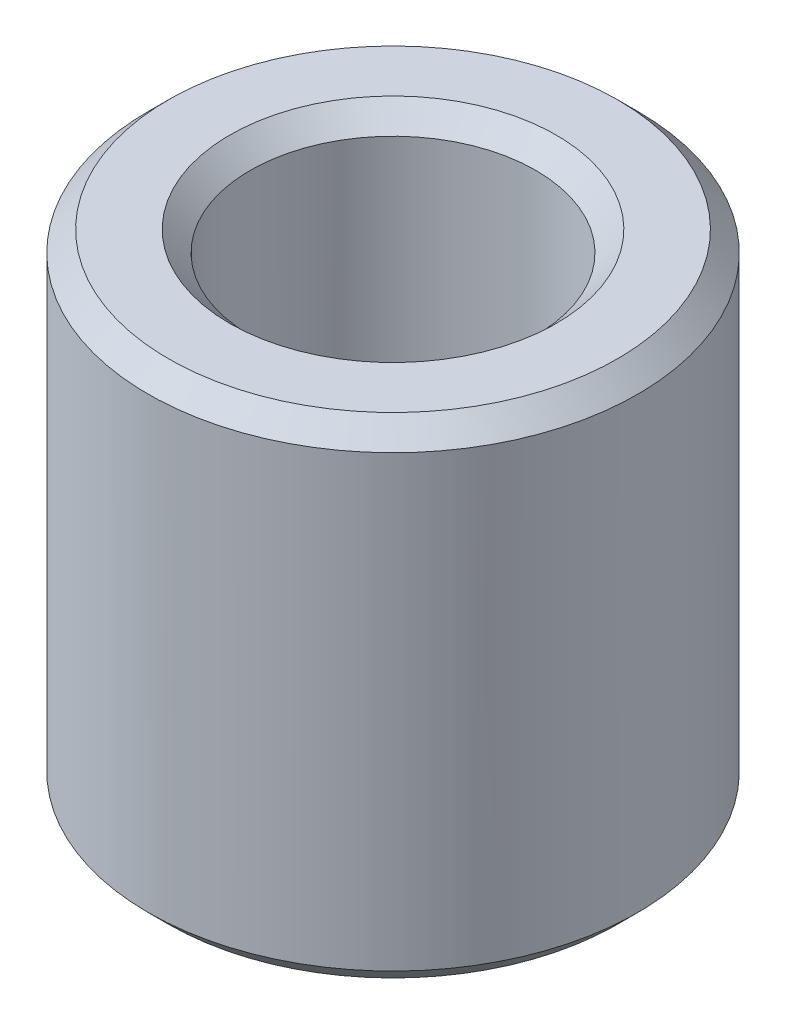
ISO-10303-21;
HEADER;
FILE_DESCRIPTION(('STEP AP214'),'2;1');
FILE_NAME('part.step','',(''),(''),'','','');
FILE_SCHEMA(('AUTOMOTIVE_DESIGN { 1 0 10303 214 1 1 1 1 }'));
ENDSEC;
DATA;
#1=APPLICATION_CONTEXT('core data for automotive mechanical design processes');
#2=APPLICATION_PROTOCOL_DEFINITION('international standard','automotive_design',2000,#1);
#3=PRODUCT_CONTEXT('',#1,'mechanical');
#4=PRODUCT('Part','Part','',(#3));
#5=PRODUCT_RELATED_PRODUCT_CATEGORY('part','',(#4));
#6=PRODUCT_DEFINITION_FORMATION('','',#4);
#7=PRODUCT_DEFINITION_CONTEXT('part definition',#1,'design');
#8=PRODUCT_DEFINITION('design','',#6,#7);
#9=PRODUCT_DEFINITION_SHAPE('','',#8);
#10=(LENGTH_UNIT() NAMED_UNIT(*) SI_UNIT(.MILLI.,.METRE.));
#11=(NAMED_UNIT(*) PLANE_ANGLE_UNIT() SI_UNIT($,.RADIAN.));
#12=(NAMED_UNIT(*) SI_UNIT($,.STERADIAN.) SOLID_ANGLE_UNIT());
#13=UNCERTAINTY_MEASURE_WITH_UNIT(LENGTH_MEASURE(1.E-05),#10,'distance_accuracy_value','');
#14=(GEOMETRIC_REPRESENTATION_CONTEXT(3) GLOBAL_UNCERTAINTY_ASSIGNED_CONTEXT((#13)) GLOBAL_UNIT_ASSIGNED_CONTEXT((#10,
#11,#12)) REPRESENTATION_CONTEXT('',''));
#15=CARTESIAN_POINT('',(0.,0.,0.));
#16=DIRECTION('',(0.,0.,1.));
#17=DIRECTION('',(1.,0.,0.));
#18=AXIS2_PLACEMENT_3D('',#15,#16,#17);
#19=CARTESIAN_POINT('',(0.,6.,0.));
#20=DIRECTION('',(0.,-1.,0.));
#21=DIRECTION('',(0.,0.,-1.));
#22=AXIS2_PLACEMENT_3D('',#19,#20,#21);
#23=CYLINDRICAL_SURFACE('',#22,1.75);
#24=CARTESIAN_POINT('',(0.,0.250000000050932,0.));
#25=DIRECTION('',(0.,-1.,0.));
#26=DIRECTION('',(0.,0.,-1.));
#27=AXIS2_PLACEMENT_3D('',#24,#25,#26);
#28=CIRCLE('',#27,1.75000000001546);
#29=CARTESIAN_POINT('',(0.,0.250000000050932,-1.75000000001546));
#30=VERTEX_POINT('',#29);
#31=EDGE_CURVE('E35',#30,#30,#28,.T.);
#32=ORIENTED_EDGE('',*,*,#31,.T.);
#33=EDGE_LOOP('',(#32));
#34=FACE_BOUND('',#33,.T.);
#35=CARTESIAN_POINT('',(0.,5.75000000003456,0.));
#36=DIRECTION('',(0.,1.,0.));
#37=DIRECTION('',(0.,0.,1.));
#38=AXIS2_PLACEMENT_3D('',#35,#36,#37);
#39=CIRCLE('',#38,1.75000000001546);
#40=CARTESIAN_POINT('',(0.,5.75000000003456,1.75000000001546));
#41=VERTEX_POINT('',#40);
#42=EDGE_CURVE('E32',#41,#41,#39,.T.);
#43=ORIENTED_EDGE('',*,*,#42,.T.);
#44=EDGE_LOOP('',(#43));
#45=FACE_BOUND('',#44,.T.);
#46=ADVANCED_FACE('F15',(#34,#45),#23,.F.);
#47=CARTESIAN_POINT('',(0.,0.,0.));
#48=DIRECTION('',(0.,-1.,0.));
#49=DIRECTION('',(0.,0.,-1.));
#50=AXIS2_PLACEMENT_3D('',#47,#48,#49);
#51=CONICAL_SURFACE('',#50,2.00000000000955,0.785398163283761);
#52=CARTESIAN_POINT('',(0.,0.,0.));
#53=DIRECTION('',(0.,-1.,0.));
#54=DIRECTION('',(0.,0.,-1.));
#55=AXIS2_PLACEMENT_3D('',#52,#53,#54);
#56=CIRCLE('',#55,2.00000000000955);
#57=CARTESIAN_POINT('',(0.,0.,-2.00000000000955));
#58=VERTEX_POINT('',#57);
#59=EDGE_CURVE('E18',#58,#58,#56,.T.);
#60=ORIENTED_EDGE('',*,*,#59,.T.);
#61=EDGE_LOOP('',(#60));
#62=FACE_BOUND('',#61,.T.);
#63=ORIENTED_EDGE('',*,*,#31,.F.);
#64=EDGE_LOOP('',(#63));
#65=FACE_BOUND('',#64,.T.);
#66=ADVANCED_FACE('F49',(#62,#65),#51,.F.);
#67=CARTESIAN_POINT('',(0.,6.00000000002865,0.));
#68=DIRECTION('',(0.,1.,0.));
#69=DIRECTION('',(0.,0.,1.));
#70=AXIS2_PLACEMENT_3D('',#67,#68,#69);
#71=CONICAL_SURFACE('',#70,2.00000000000955,0.785398163397448);
#72=CARTESIAN_POINT('',(0.,6.00000000002865,0.));
#73=DIRECTION('',(0.,1.,0.));
#74=DIRECTION('',(0.,0.,1.));
#75=AXIS2_PLACEMENT_3D('',#72,#73,#74);
#76=CIRCLE('',#75,2.00000000000955);
#77=CARTESIAN_POINT('',(0.,6.00000000002865,2.00000000000955));
#78=VERTEX_POINT('',#77);
#79=EDGE_CURVE('E42',#78,#78,#76,.F.);
#80=ORIENTED_EDGE('',*,*,#79,.F.);
#81=EDGE_LOOP('',(#80));
#82=FACE_BOUND('',#81,.T.);
#83=ORIENTED_EDGE('',*,*,#42,.F.);
#84=EDGE_LOOP('',(#83));
#85=FACE_BOUND('',#84,.T.);
#86=ADVANCED_FACE('F56',(#82,#85),#71,.F.);
#87=CARTESIAN_POINT('',(0.,0.,0.));
#88=DIRECTION('',(0.,1.,0.));
#89=DIRECTION('',(0.,0.,1.));
#90=AXIS2_PLACEMENT_3D('',#87,#88,#89);
#91=PLANE('',#90);
#92=ORIENTED_EDGE('',*,*,#59,.F.);
#93=EDGE_LOOP('',(#92));
#94=FACE_BOUND('',#93,.T.);
#95=CARTESIAN_POINT('',(0.,-5.6843418860808E-11,0.));
#96=DIRECTION('',(0.,1.,0.));
#97=DIRECTION('',(0.,0.,1.));
#98=AXIS2_PLACEMENT_3D('',#95,#96,#97);
#99=CIRCLE('',#98,2.74999999993497);
#100=CARTESIAN_POINT('',(0.,-5.6843418860808E-11,2.74999999993497));
#101=VERTEX_POINT('',#100);
#102=EDGE_CURVE('E40',#101,#101,#99,.T.);
#103=ORIENTED_EDGE('',*,*,#102,.F.);
#104=EDGE_LOOP('',(#103));
#105=FACE_BOUND('',#104,.T.);
#106=ADVANCED_FACE('F52',(#94,#105),#91,.F.);
#107=CARTESIAN_POINT('',(0.,6.,0.));
#108=DIRECTION('',(0.,1.,0.));
#109=DIRECTION('',(0.,0.,1.));
#110=AXIS2_PLACEMENT_3D('',#107,#108,#109);
#111=PLANE('',#110);
#112=ORIENTED_EDGE('',*,*,#79,.T.);
#113=EDGE_LOOP('',(#112));
#114=FACE_BOUND('',#113,.T.);
#115=CARTESIAN_POINT('',(0.,5.99999999997181,0.));
#116=DIRECTION('',(0.,-1.,0.));
#117=DIRECTION('',(0.,0.,-1.));
#118=AXIS2_PLACEMENT_3D('',#115,#116,#117);
#119=CIRCLE('',#118,2.74999999993497);
#120=CARTESIAN_POINT('',(0.,5.99999999997181,-2.74999999993497));
#121=VERTEX_POINT('',#120);
#122=EDGE_CURVE('E27',#121,#121,#119,.T.);
#123=ORIENTED_EDGE('',*,*,#122,.F.);
#124=EDGE_LOOP('',(#123));
#125=FACE_BOUND('',#124,.T.);
#126=ADVANCED_FACE('F55',(#114,#125),#111,.T.);
#127=CARTESIAN_POINT('',(0.,0.249999999937245,0.));
#128=DIRECTION('',(0.,1.,0.));
#129=DIRECTION('',(0.,0.,1.));
#130=AXIS2_PLACEMENT_3D('',#127,#128,#129);
#131=CONICAL_SURFACE('',#130,2.99999999992906,0.785398163397448);
#132=ORIENTED_EDGE('',*,*,#102,.T.);
#133=EDGE_LOOP('',(#132));
#134=FACE_BOUND('',#133,.T.);
#135=CARTESIAN_POINT('',(0.,0.25,0.));
#136=DIRECTION('',(0.,-1.,0.));
#137=DIRECTION('',(0.,0.,-1.));
#138=AXIS2_PLACEMENT_3D('',#135,#136,#137);
#139=CIRCLE('',#138,3.);
#140=CARTESIAN_POINT('',(0.,0.25,-3.));
#141=VERTEX_POINT('',#140);
#142=EDGE_CURVE('E22',#141,#141,#139,.F.);
#143=ORIENTED_EDGE('',*,*,#142,.F.);
#144=EDGE_LOOP('',(#143));
#145=FACE_BOUND('',#144,.T.);
#146=ADVANCED_FACE('F60',(#134,#145),#131,.T.);
#147=CARTESIAN_POINT('',(0.,5.74999999997772,0.));
#148=DIRECTION('',(0.,-1.,0.));
#149=DIRECTION('',(0.,0.,-1.));
#150=AXIS2_PLACEMENT_3D('',#147,#148,#149);
#151=CONICAL_SURFACE('',#150,2.99999999992906,0.785398163397448);
#152=ORIENTED_EDGE('',*,*,#122,.T.);
#153=EDGE_LOOP('',(#152));
#154=FACE_BOUND('',#153,.T.);
#155=CARTESIAN_POINT('',(0.,5.75,0.));
#156=DIRECTION('',(0.,-1.,0.));
#157=DIRECTION('',(0.,0.,-1.));
#158=AXIS2_PLACEMENT_3D('',#155,#156,#157);
#159=CIRCLE('',#158,3.);
#160=CARTESIAN_POINT('',(0.,5.75,-3.));
#161=VERTEX_POINT('',#160);
#162=EDGE_CURVE('E10',#161,#161,#159,.T.);
#163=ORIENTED_EDGE('',*,*,#162,.F.);
#164=EDGE_LOOP('',(#163));
#165=FACE_BOUND('',#164,.T.);
#166=ADVANCED_FACE('F63',(#154,#165),#151,.T.);
#167=CARTESIAN_POINT('',(0.,6.,0.));
#168=DIRECTION('',(0.,-1.,0.));
#169=DIRECTION('',(0.,0.,-1.));
#170=AXIS2_PLACEMENT_3D('',#167,#168,#169);
#171=CYLINDRICAL_SURFACE('',#170,3.);
#172=ORIENTED_EDGE('',*,*,#162,.T.);
#173=EDGE_LOOP('',(#172));
#174=FACE_BOUND('',#173,.T.);
#175=ORIENTED_EDGE('',*,*,#142,.T.);
#176=EDGE_LOOP('',(#175));
#177=FACE_BOUND('',#176,.T.);
#178=ADVANCED_FACE('F67',(#174,#177),#171,.T.);
#179=CLOSED_SHELL('',(#46,#66,#86,#106,#126,#146,#166,#178));
#180=MANIFOLD_SOLID_BREP('B1',#179);
#181=ADVANCED_BREP_SHAPE_REPRESENTATION('',(#18,#180),#14);
#182=SHAPE_DEFINITION_REPRESENTATION(#9,#181);
ENDSEC;
END-ISO-10303-21;
